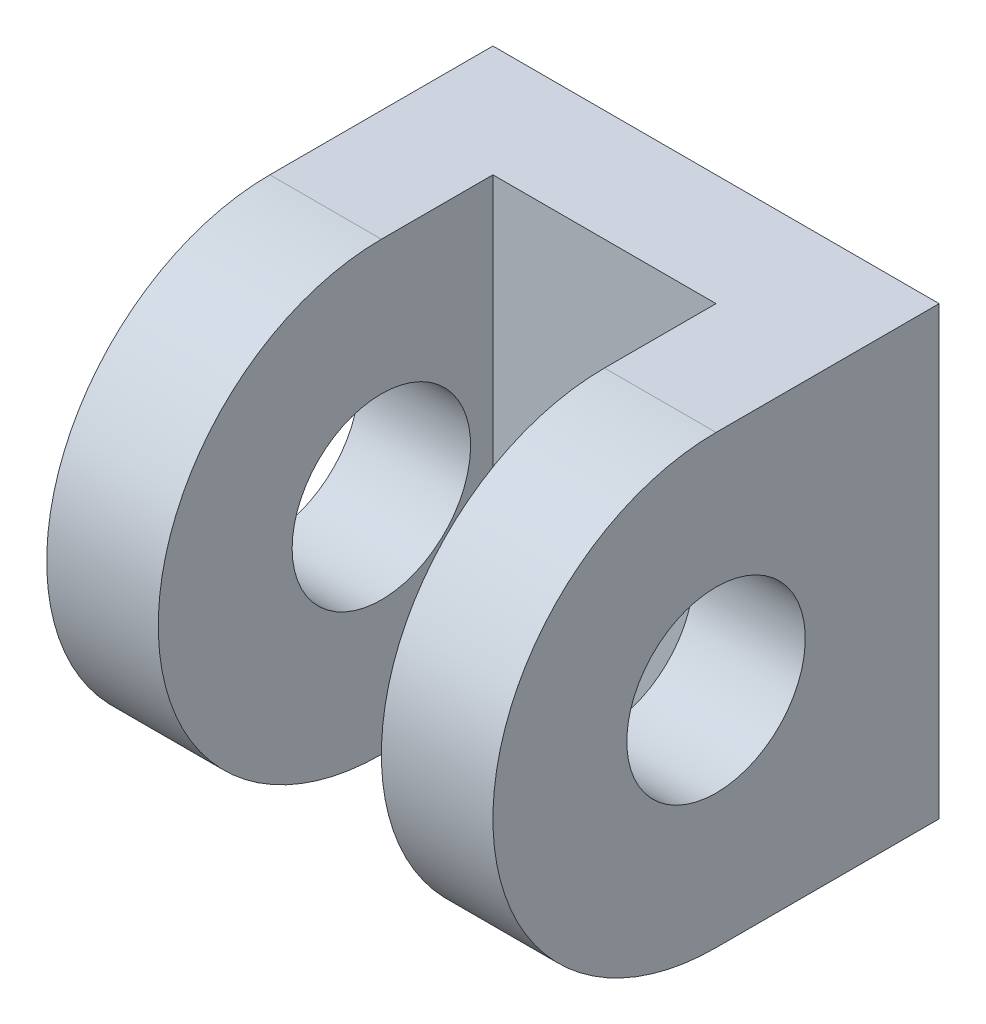
ISO-10303-21;
HEADER;
FILE_DESCRIPTION(('STEP AP214'),'2;1');
FILE_NAME('part.step','',(''),(''),'','','');
FILE_SCHEMA(('AUTOMOTIVE_DESIGN { 1 0 10303 214 1 1 1 1 }'));
ENDSEC;
DATA;
#1=APPLICATION_CONTEXT('core data for automotive mechanical design processes');
#2=APPLICATION_PROTOCOL_DEFINITION('international standard','automotive_design',2000,#1);
#3=PRODUCT_CONTEXT('',#1,'mechanical');
#4=PRODUCT('Part','Part','',(#3));
#5=PRODUCT_RELATED_PRODUCT_CATEGORY('part','',(#4));
#6=PRODUCT_DEFINITION_FORMATION('','',#4);
#7=PRODUCT_DEFINITION_CONTEXT('part definition',#1,'design');
#8=PRODUCT_DEFINITION('design','',#6,#7);
#9=PRODUCT_DEFINITION_SHAPE('','',#8);
#10=(LENGTH_UNIT() NAMED_UNIT(*) SI_UNIT(.MILLI.,.METRE.));
#11=(NAMED_UNIT(*) PLANE_ANGLE_UNIT() SI_UNIT($,.RADIAN.));
#12=(NAMED_UNIT(*) SI_UNIT($,.STERADIAN.) SOLID_ANGLE_UNIT());
#13=UNCERTAINTY_MEASURE_WITH_UNIT(LENGTH_MEASURE(1.E-05),#10,'distance_accuracy_value','');
#14=(GEOMETRIC_REPRESENTATION_CONTEXT(3) GLOBAL_UNCERTAINTY_ASSIGNED_CONTEXT((#13)) GLOBAL_UNIT_ASSIGNED_CONTEXT((#10,
#11,#12)) REPRESENTATION_CONTEXT('',''));
#15=CARTESIAN_POINT('',(0.,0.,0.));
#16=DIRECTION('',(0.,0.,1.));
#17=DIRECTION('',(1.,0.,0.));
#18=AXIS2_PLACEMENT_3D('',#15,#16,#17);
#19=CARTESIAN_POINT('',(0.,0.,5.));
#20=DIRECTION('',(0.,0.,-1.));
#21=DIRECTION('',(-1.,0.,0.));
#22=AXIS2_PLACEMENT_3D('',#19,#20,#21);
#23=PLANE('',#22);
#24=DIRECTION('',(0.,-1.,0.));
#25=VECTOR('',#24,1.);
#26=CARTESIAN_POINT('',(15.,0.,5.));
#27=LINE('',#26,#25);
#28=CARTESIAN_POINT('',(15.,20.,5.));
#29=VERTEX_POINT('',#28);
#30=CARTESIAN_POINT('',(15.,0.,5.));
#31=VERTEX_POINT('',#30);
#32=EDGE_CURVE('E48',#29,#31,#27,.T.);
#33=ORIENTED_EDGE('',*,*,#32,.F.);
#34=DIRECTION('',(-1.,0.,0.));
#35=VECTOR('',#34,1.);
#36=CARTESIAN_POINT('',(0.,20.,5.));
#37=LINE('',#36,#35);
#38=CARTESIAN_POINT('',(5.,20.,5.));
#39=VERTEX_POINT('',#38);
#40=EDGE_CURVE('E121',#29,#39,#37,.T.);
#41=ORIENTED_EDGE('',*,*,#40,.T.);
#42=DIRECTION('',(0.,1.,0.));
#43=VECTOR('',#42,1.);
#44=CARTESIAN_POINT('',(5.,0.,5.));
#45=LINE('',#44,#43);
#46=CARTESIAN_POINT('',(5.,0.,5.));
#47=VERTEX_POINT('',#46);
#48=EDGE_CURVE('E55',#47,#39,#45,.T.);
#49=ORIENTED_EDGE('',*,*,#48,.F.);
#50=DIRECTION('',(1.,0.,0.));
#51=VECTOR('',#50,1.);
#52=CARTESIAN_POINT('',(20.,0.,5.));
#53=LINE('',#52,#51);
#54=EDGE_CURVE('E157',#47,#31,#53,.T.);
#55=ORIENTED_EDGE('',*,*,#54,.T.);
#56=EDGE_LOOP('',(#33,#41,#49,#55));
#57=FACE_BOUND('',#56,.T.);
#58=ADVANCED_FACE('F32',(#57),#23,.F.);
#59=CARTESIAN_POINT('',(20.,0.,5.));
#60=DIRECTION('',(0.,1.,0.));
#61=DIRECTION('',(-1.,0.,0.));
#62=AXIS2_PLACEMENT_3D('',#59,#60,#61);
#63=PLANE('',#62);
#64=DIRECTION('',(1.,0.,0.));
#65=VECTOR('',#64,1.);
#66=CARTESIAN_POINT('',(20.,0.,0.));
#67=LINE('',#66,#65);
#68=CARTESIAN_POINT('',(0.,0.,0.));
#69=VERTEX_POINT('',#68);
#70=CARTESIAN_POINT('',(20.,0.,0.));
#71=VERTEX_POINT('',#70);
#72=EDGE_CURVE('E156',#69,#71,#67,.T.);
#73=ORIENTED_EDGE('',*,*,#72,.T.);
#74=DIRECTION('',(0.,0.,-1.));
#75=VECTOR('',#74,1.);
#76=CARTESIAN_POINT('',(20.,0.,5.));
#77=LINE('',#76,#75);
#78=CARTESIAN_POINT('',(20.,0.,10.));
#79=VERTEX_POINT('',#78);
#80=EDGE_CURVE('E11',#79,#71,#77,.T.);
#81=ORIENTED_EDGE('',*,*,#80,.F.);
#82=DIRECTION('',(1.,0.,0.));
#83=VECTOR('',#82,1.);
#84=CARTESIAN_POINT('',(20.,0.,10.));
#85=LINE('',#84,#83);
#86=CARTESIAN_POINT('',(15.,0.,10.));
#87=VERTEX_POINT('',#86);
#88=EDGE_CURVE('E142',#87,#79,#85,.T.);
#89=ORIENTED_EDGE('',*,*,#88,.F.);
#90=DIRECTION('',(0.,0.,-1.));
#91=VECTOR('',#90,1.);
#92=CARTESIAN_POINT('',(15.,0.,10.));
#93=LINE('',#92,#91);
#94=EDGE_CURVE('E145',#87,#31,#93,.T.);
#95=ORIENTED_EDGE('',*,*,#94,.T.);
#96=ORIENTED_EDGE('',*,*,#54,.F.);
#97=DIRECTION('',(0.,0.,-1.));
#98=VECTOR('',#97,1.);
#99=CARTESIAN_POINT('',(5.,0.,10.));
#100=LINE('',#99,#98);
#101=CARTESIAN_POINT('',(5.,0.,10.));
#102=VERTEX_POINT('',#101);
#103=EDGE_CURVE('E105',#102,#47,#100,.T.);
#104=ORIENTED_EDGE('',*,*,#103,.F.);
#105=DIRECTION('',(1.,0.,0.));
#106=VECTOR('',#105,1.);
#107=CARTESIAN_POINT('',(0.,0.,10.));
#108=LINE('',#107,#106);
#109=CARTESIAN_POINT('',(0.,0.,10.));
#110=VERTEX_POINT('',#109);
#111=EDGE_CURVE('E99',#110,#102,#108,.T.);
#112=ORIENTED_EDGE('',*,*,#111,.F.);
#113=DIRECTION('',(0.,0.,-1.));
#114=VECTOR('',#113,1.);
#115=CARTESIAN_POINT('',(0.,0.,5.));
#116=LINE('',#115,#114);
#117=EDGE_CURVE('E102',#110,#69,#116,.T.);
#118=ORIENTED_EDGE('',*,*,#117,.T.);
#119=EDGE_LOOP('',(#73,#81,#89,#95,#96,#104,#112,#118));
#120=FACE_BOUND('',#119,.T.);
#121=ADVANCED_FACE('F34',(#120),#63,.F.);
#122=CARTESIAN_POINT('',(20.,20.,5.));
#123=DIRECTION('',(-1.,0.,0.));
#124=DIRECTION('',(0.,-1.,0.));
#125=AXIS2_PLACEMENT_3D('',#122,#123,#124);
#126=PLANE('',#125);
#127=CARTESIAN_POINT('',(20.,10.,10.));
#128=DIRECTION('',(1.,0.,0.));
#129=DIRECTION('',(0.,1.,0.));
#130=AXIS2_PLACEMENT_3D('',#127,#128,#129);
#131=CIRCLE('',#130,4.);
#132=CARTESIAN_POINT('',(20.,14.,10.));
#133=VERTEX_POINT('',#132);
#134=EDGE_CURVE('E207',#133,#133,#131,.T.);
#135=ORIENTED_EDGE('',*,*,#134,.F.);
#136=EDGE_LOOP('',(#135));
#137=FACE_BOUND('',#136,.T.);
#138=DIRECTION('',(0.,1.,0.));
#139=VECTOR('',#138,1.);
#140=CARTESIAN_POINT('',(20.,20.,0.));
#141=LINE('',#140,#139);
#142=CARTESIAN_POINT('',(20.,20.,0.));
#143=VERTEX_POINT('',#142);
#144=EDGE_CURVE('E161',#71,#143,#141,.T.);
#145=ORIENTED_EDGE('',*,*,#144,.T.);
#146=DIRECTION('',(0.,0.,-1.));
#147=VECTOR('',#146,1.);
#148=CARTESIAN_POINT('',(20.,20.,5.));
#149=LINE('',#148,#147);
#150=CARTESIAN_POINT('',(20.,20.,10.));
#151=VERTEX_POINT('',#150);
#152=EDGE_CURVE('E41',#151,#143,#149,.T.);
#153=ORIENTED_EDGE('',*,*,#152,.F.);
#154=CARTESIAN_POINT('',(20.,10.,10.));
#155=DIRECTION('',(1.,0.,0.));
#156=DIRECTION('',(0.,1.,0.));
#157=AXIS2_PLACEMENT_3D('',#154,#155,#156);
#158=CIRCLE('',#157,10.);
#159=EDGE_CURVE('E129',#151,#79,#158,.T.);
#160=ORIENTED_EDGE('',*,*,#159,.T.);
#161=ORIENTED_EDGE('',*,*,#80,.T.);
#162=EDGE_LOOP('',(#145,#153,#160,#161));
#163=FACE_BOUND('',#162,.T.);
#164=ADVANCED_FACE('F180',(#137,#163),#126,.F.);
#165=CARTESIAN_POINT('',(0.,20.,5.));
#166=DIRECTION('',(0.,-1.,0.));
#167=DIRECTION('',(0.,0.,-1.));
#168=AXIS2_PLACEMENT_3D('',#165,#166,#167);
#169=PLANE('',#168);
#170=DIRECTION('',(-1.,0.,0.));
#171=VECTOR('',#170,1.);
#172=CARTESIAN_POINT('',(0.,20.,0.));
#173=LINE('',#172,#171);
#174=CARTESIAN_POINT('',(0.,20.,0.));
#175=VERTEX_POINT('',#174);
#176=EDGE_CURVE('E163',#143,#175,#173,.T.);
#177=ORIENTED_EDGE('',*,*,#176,.T.);
#178=DIRECTION('',(0.,0.,-1.));
#179=VECTOR('',#178,1.);
#180=CARTESIAN_POINT('',(0.,20.,5.));
#181=LINE('',#180,#179);
#182=CARTESIAN_POINT('',(0.,20.,10.));
#183=VERTEX_POINT('',#182);
#184=EDGE_CURVE('E120',#183,#175,#181,.T.);
#185=ORIENTED_EDGE('',*,*,#184,.F.);
#186=DIRECTION('',(-1.,0.,0.));
#187=VECTOR('',#186,1.);
#188=CARTESIAN_POINT('',(5.,20.,10.));
#189=LINE('',#188,#187);
#190=CARTESIAN_POINT('',(5.,20.,10.));
#191=VERTEX_POINT('',#190);
#192=EDGE_CURVE('E111',#191,#183,#189,.T.);
#193=ORIENTED_EDGE('',*,*,#192,.F.);
#194=DIRECTION('',(0.,0.,-1.));
#195=VECTOR('',#194,1.);
#196=CARTESIAN_POINT('',(5.,20.,10.));
#197=LINE('',#196,#195);
#198=EDGE_CURVE('E110',#191,#39,#197,.T.);
#199=ORIENTED_EDGE('',*,*,#198,.T.);
#200=ORIENTED_EDGE('',*,*,#40,.F.);
#201=DIRECTION('',(0.,0.,-1.));
#202=VECTOR('',#201,1.);
#203=CARTESIAN_POINT('',(15.,20.,10.));
#204=LINE('',#203,#202);
#205=CARTESIAN_POINT('',(15.,20.,10.));
#206=VERTEX_POINT('',#205);
#207=EDGE_CURVE('E149',#206,#29,#204,.T.);
#208=ORIENTED_EDGE('',*,*,#207,.F.);
#209=DIRECTION('',(-1.,0.,0.));
#210=VECTOR('',#209,1.);
#211=CARTESIAN_POINT('',(15.,20.,10.));
#212=LINE('',#211,#210);
#213=EDGE_CURVE('E139',#151,#206,#212,.T.);
#214=ORIENTED_EDGE('',*,*,#213,.F.);
#215=ORIENTED_EDGE('',*,*,#152,.T.);
#216=EDGE_LOOP('',(#177,#185,#193,#199,#200,#208,#214,#215));
#217=FACE_BOUND('',#216,.T.);
#218=ADVANCED_FACE('F171',(#217),#169,.F.);
#219=CARTESIAN_POINT('',(0.,0.,5.));
#220=DIRECTION('',(1.,0.,0.));
#221=DIRECTION('',(0.,0.,-1.));
#222=AXIS2_PLACEMENT_3D('',#219,#220,#221);
#223=PLANE('',#222);
#224=CARTESIAN_POINT('',(0.,9.99999999999999,10.));
#225=DIRECTION('',(1.,0.,0.));
#226=DIRECTION('',(0.,1.,0.));
#227=AXIS2_PLACEMENT_3D('',#224,#225,#226);
#228=CIRCLE('',#227,4.);
#229=CARTESIAN_POINT('',(0.,14.,10.));
#230=VERTEX_POINT('',#229);
#231=EDGE_CURVE('E205',#230,#230,#228,.T.);
#232=ORIENTED_EDGE('',*,*,#231,.T.);
#233=EDGE_LOOP('',(#232));
#234=FACE_BOUND('',#233,.T.);
#235=ORIENTED_EDGE('',*,*,#117,.F.);
#236=CARTESIAN_POINT('',(0.,10.,10.));
#237=DIRECTION('',(-1.,0.,0.));
#238=DIRECTION('',(0.,0.,1.));
#239=AXIS2_PLACEMENT_3D('',#236,#237,#238);
#240=CIRCLE('',#239,10.);
#241=EDGE_CURVE('E117',#110,#183,#240,.T.);
#242=ORIENTED_EDGE('',*,*,#241,.T.);
#243=ORIENTED_EDGE('',*,*,#184,.T.);
#244=DIRECTION('',(0.,-1.,0.));
#245=VECTOR('',#244,1.);
#246=CARTESIAN_POINT('',(0.,0.,0.));
#247=LINE('',#246,#245);
#248=EDGE_CURVE('E119',#175,#69,#247,.T.);
#249=ORIENTED_EDGE('',*,*,#248,.T.);
#250=EDGE_LOOP('',(#235,#242,#243,#249));
#251=FACE_BOUND('',#250,.T.);
#252=ADVANCED_FACE('F115',(#234,#251),#223,.F.);
#253=CARTESIAN_POINT('',(0.,0.,0.));
#254=DIRECTION('',(0.,0.,-1.));
#255=DIRECTION('',(-1.,0.,0.));
#256=AXIS2_PLACEMENT_3D('',#253,#254,#255);
#257=PLANE('',#256);
#258=ORIENTED_EDGE('',*,*,#72,.F.);
#259=ORIENTED_EDGE('',*,*,#248,.F.);
#260=ORIENTED_EDGE('',*,*,#176,.F.);
#261=ORIENTED_EDGE('',*,*,#144,.F.);
#262=EDGE_LOOP('',(#258,#259,#260,#261));
#263=FACE_BOUND('',#262,.T.);
#264=ADVANCED_FACE('F175',(#263),#257,.T.);
#265=CARTESIAN_POINT('',(5.,0.,10.));
#266=DIRECTION('',(-1.,0.,0.));
#267=DIRECTION('',(0.,0.,1.));
#268=AXIS2_PLACEMENT_3D('',#265,#266,#267);
#269=PLANE('',#268);
#270=CARTESIAN_POINT('',(5.,10.,10.));
#271=DIRECTION('',(-1.,0.,0.));
#272=DIRECTION('',(0.,0.,1.));
#273=AXIS2_PLACEMENT_3D('',#270,#271,#272);
#274=CIRCLE('',#273,4.);
#275=CARTESIAN_POINT('',(5.,10.,14.));
#276=VERTEX_POINT('',#275);
#277=EDGE_CURVE('E127',#276,#276,#274,.T.);
#278=ORIENTED_EDGE('',*,*,#277,.T.);
#279=EDGE_LOOP('',(#278));
#280=FACE_BOUND('',#279,.T.);
#281=ORIENTED_EDGE('',*,*,#48,.T.);
#282=ORIENTED_EDGE('',*,*,#198,.F.);
#283=CARTESIAN_POINT('',(5.,10.,10.));
#284=DIRECTION('',(-1.,0.,0.));
#285=DIRECTION('',(0.,0.,1.));
#286=AXIS2_PLACEMENT_3D('',#283,#284,#285);
#287=CIRCLE('',#286,10.);
#288=EDGE_CURVE('E126',#102,#191,#287,.T.);
#289=ORIENTED_EDGE('',*,*,#288,.F.);
#290=ORIENTED_EDGE('',*,*,#103,.T.);
#291=EDGE_LOOP('',(#281,#282,#289,#290));
#292=FACE_BOUND('',#291,.T.);
#293=ADVANCED_FACE('F195',(#280,#292),#269,.F.);
#294=CARTESIAN_POINT('',(15.,0.,10.));
#295=DIRECTION('',(1.,0.,0.));
#296=DIRECTION('',(0.,0.,-1.));
#297=AXIS2_PLACEMENT_3D('',#294,#295,#296);
#298=PLANE('',#297);
#299=CARTESIAN_POINT('',(15.,10.,10.));
#300=DIRECTION('',(1.,0.,0.));
#301=DIRECTION('',(0.,0.,-1.));
#302=AXIS2_PLACEMENT_3D('',#299,#300,#301);
#303=CIRCLE('',#302,4.);
#304=CARTESIAN_POINT('',(15.,10.,6.));
#305=VERTEX_POINT('',#304);
#306=EDGE_CURVE('E36',#305,#305,#303,.T.);
#307=ORIENTED_EDGE('',*,*,#306,.T.);
#308=EDGE_LOOP('',(#307));
#309=FACE_BOUND('',#308,.T.);
#310=ORIENTED_EDGE('',*,*,#94,.F.);
#311=CARTESIAN_POINT('',(15.,10.,10.));
#312=DIRECTION('',(1.,0.,0.));
#313=DIRECTION('',(0.,1.,0.));
#314=AXIS2_PLACEMENT_3D('',#311,#312,#313);
#315=CIRCLE('',#314,10.);
#316=EDGE_CURVE('E134',#206,#87,#315,.T.);
#317=ORIENTED_EDGE('',*,*,#316,.F.);
#318=ORIENTED_EDGE('',*,*,#207,.T.);
#319=ORIENTED_EDGE('',*,*,#32,.T.);
#320=EDGE_LOOP('',(#310,#317,#318,#319));
#321=FACE_BOUND('',#320,.T.);
#322=ADVANCED_FACE('F220',(#309,#321),#298,.F.);
#323=CARTESIAN_POINT('',(15.,10.,10.));
#324=DIRECTION('',(1.,0.,0.));
#325=DIRECTION('',(0.,1.,0.));
#326=AXIS2_PLACEMENT_3D('',#323,#324,#325);
#327=CYLINDRICAL_SURFACE('',#326,10.);
#328=ORIENTED_EDGE('',*,*,#213,.T.);
#329=ORIENTED_EDGE('',*,*,#316,.T.);
#330=ORIENTED_EDGE('',*,*,#88,.T.);
#331=ORIENTED_EDGE('',*,*,#159,.F.);
#332=EDGE_LOOP('',(#328,#329,#330,#331));
#333=FACE_BOUND('',#332,.T.);
#334=ADVANCED_FACE('F178',(#333),#327,.T.);
#335=CARTESIAN_POINT('',(5.,10.,10.));
#336=DIRECTION('',(-1.,0.,0.));
#337=DIRECTION('',(0.,0.,1.));
#338=AXIS2_PLACEMENT_3D('',#335,#336,#337);
#339=CYLINDRICAL_SURFACE('',#338,10.);
#340=ORIENTED_EDGE('',*,*,#288,.T.);
#341=ORIENTED_EDGE('',*,*,#192,.T.);
#342=ORIENTED_EDGE('',*,*,#241,.F.);
#343=ORIENTED_EDGE('',*,*,#111,.T.);
#344=EDGE_LOOP('',(#340,#341,#342,#343));
#345=FACE_BOUND('',#344,.T.);
#346=ADVANCED_FACE('F124',(#345),#339,.T.);
#347=CARTESIAN_POINT('',(0.,9.99999999999999,10.));
#348=DIRECTION('',(1.,0.,0.));
#349=DIRECTION('',(0.,1.,0.));
#350=AXIS2_PLACEMENT_3D('',#347,#348,#349);
#351=CYLINDRICAL_SURFACE('',#350,4.);
#352=ORIENTED_EDGE('',*,*,#134,.T.);
#353=EDGE_LOOP('',(#352));
#354=FACE_BOUND('',#353,.T.);
#355=ORIENTED_EDGE('',*,*,#306,.F.);
#356=EDGE_LOOP('',(#355));
#357=FACE_BOUND('',#356,.T.);
#358=ADVANCED_FACE('F213',(#354,#357),#351,.F.);
#359=ORIENTED_EDGE('',*,*,#231,.F.);
#360=EDGE_LOOP('',(#359));
#361=FACE_BOUND('',#360,.T.);
#362=ORIENTED_EDGE('',*,*,#277,.F.);
#363=EDGE_LOOP('',(#362));
#364=FACE_BOUND('',#363,.T.);
#365=ADVANCED_FACE('F216',(#361,#364),#351,.F.);
#366=CLOSED_SHELL('',(#58,#121,#164,#218,#252,#264,#293,#322,#334,#346,#358,#365));
#367=MANIFOLD_SOLID_BREP('B2',#366);
#368=ADVANCED_BREP_SHAPE_REPRESENTATION('',(#18,#367),#14);
#369=SHAPE_DEFINITION_REPRESENTATION(#9,#368);
ENDSEC;
END-ISO-10303-21;
